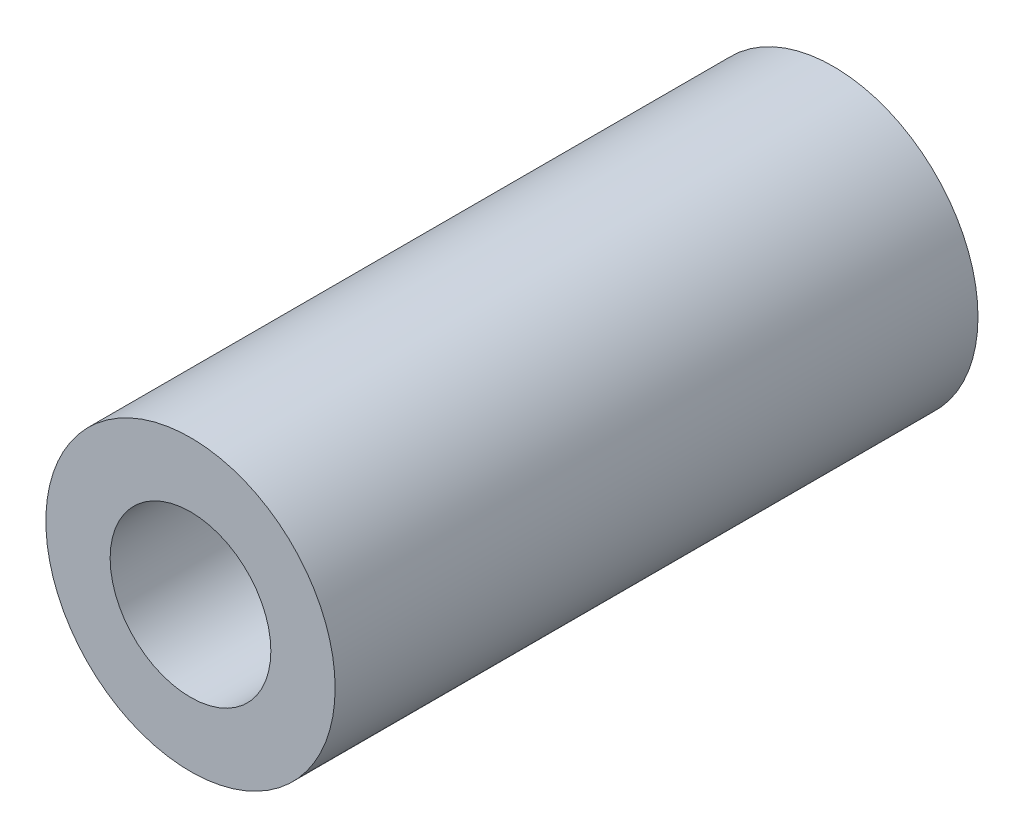
ISO-10303-21;
HEADER;
FILE_DESCRIPTION(('STEP AP214'),'2;1');
FILE_NAME('part.step','',(''),(''),'','','');
FILE_SCHEMA(('AUTOMOTIVE_DESIGN { 1 0 10303 214 1 1 1 1 }'));
ENDSEC;
DATA;
#1=APPLICATION_CONTEXT('core data for automotive mechanical design processes');
#2=APPLICATION_PROTOCOL_DEFINITION('international standard','automotive_design',2000,#1);
#3=PRODUCT_CONTEXT('',#1,'mechanical');
#4=PRODUCT('Part','Part','',(#3));
#5=PRODUCT_RELATED_PRODUCT_CATEGORY('part','',(#4));
#6=PRODUCT_DEFINITION_FORMATION('','',#4);
#7=PRODUCT_DEFINITION_CONTEXT('part definition',#1,'design');
#8=PRODUCT_DEFINITION('design','',#6,#7);
#9=PRODUCT_DEFINITION_SHAPE('','',#8);
#10=(LENGTH_UNIT() NAMED_UNIT(*) SI_UNIT(.MILLI.,.METRE.));
#11=(NAMED_UNIT(*) PLANE_ANGLE_UNIT() SI_UNIT($,.RADIAN.));
#12=(NAMED_UNIT(*) SI_UNIT($,.STERADIAN.) SOLID_ANGLE_UNIT());
#13=UNCERTAINTY_MEASURE_WITH_UNIT(LENGTH_MEASURE(1.E-05),#10,'distance_accuracy_value','');
#14=(GEOMETRIC_REPRESENTATION_CONTEXT(3) GLOBAL_UNCERTAINTY_ASSIGNED_CONTEXT((#13)) GLOBAL_UNIT_ASSIGNED_CONTEXT((#10,
#11,#12)) REPRESENTATION_CONTEXT('',''));
#15=CARTESIAN_POINT('',(0.,0.,0.));
#16=DIRECTION('',(0.,0.,1.));
#17=DIRECTION('',(1.,0.,0.));
#18=AXIS2_PLACEMENT_3D('',#15,#16,#17);
#19=CARTESIAN_POINT('',(0.,0.,14.));
#20=DIRECTION('',(0.,0.,1.));
#21=DIRECTION('',(1.,0.,0.));
#22=AXIS2_PLACEMENT_3D('',#19,#20,#21);
#23=PLANE('',#22);
#24=CARTESIAN_POINT('',(0.,0.,14.));
#25=DIRECTION('',(0.,0.,1.));
#26=DIRECTION('',(1.,0.,0.));
#27=AXIS2_PLACEMENT_3D('',#24,#25,#26);
#28=CIRCLE('',#27,3.15);
#29=CARTESIAN_POINT('',(3.15,0.,14.));
#30=VERTEX_POINT('',#29);
#31=EDGE_CURVE('E10',#30,#30,#28,.T.);
#32=ORIENTED_EDGE('',*,*,#31,.T.);
#33=EDGE_LOOP('',(#32));
#34=FACE_BOUND('',#33,.T.);
#35=CARTESIAN_POINT('',(0.,0.,14.));
#36=DIRECTION('',(0.,0.,1.));
#37=DIRECTION('',(1.,0.,0.));
#38=AXIS2_PLACEMENT_3D('',#35,#36,#37);
#39=CIRCLE('',#38,1.75);
#40=CARTESIAN_POINT('',(1.75,0.,14.));
#41=VERTEX_POINT('',#40);
#42=EDGE_CURVE('E41',#41,#41,#39,.T.);
#43=ORIENTED_EDGE('',*,*,#42,.F.);
#44=EDGE_LOOP('',(#43));
#45=FACE_BOUND('',#44,.T.);
#46=ADVANCED_FACE('F30',(#34,#45),#23,.T.);
#47=CARTESIAN_POINT('',(0.,0.,0.));
#48=DIRECTION('',(0.,0.,1.));
#49=DIRECTION('',(1.,0.,0.));
#50=AXIS2_PLACEMENT_3D('',#47,#48,#49);
#51=PLANE('',#50);
#52=CARTESIAN_POINT('',(0.,0.,0.));
#53=DIRECTION('',(0.,0.,1.));
#54=DIRECTION('',(1.,0.,0.));
#55=AXIS2_PLACEMENT_3D('',#52,#53,#54);
#56=CIRCLE('',#55,3.15);
#57=CARTESIAN_POINT('',(3.15,0.,0.));
#58=VERTEX_POINT('',#57);
#59=EDGE_CURVE('E34',#58,#58,#56,.T.);
#60=ORIENTED_EDGE('',*,*,#59,.F.);
#61=EDGE_LOOP('',(#60));
#62=FACE_BOUND('',#61,.T.);
#63=CARTESIAN_POINT('',(0.,0.,0.));
#64=DIRECTION('',(0.,0.,1.));
#65=DIRECTION('',(1.,0.,0.));
#66=AXIS2_PLACEMENT_3D('',#63,#64,#65);
#67=CIRCLE('',#66,1.75);
#68=CARTESIAN_POINT('',(1.75,0.,0.));
#69=VERTEX_POINT('',#68);
#70=EDGE_CURVE('E43',#69,#69,#67,.T.);
#71=ORIENTED_EDGE('',*,*,#70,.T.);
#72=EDGE_LOOP('',(#71));
#73=FACE_BOUND('',#72,.T.);
#74=ADVANCED_FACE('F53',(#62,#73),#51,.F.);
#75=CARTESIAN_POINT('',(0.,0.,14.));
#76=DIRECTION('',(0.,0.,-1.));
#77=DIRECTION('',(-1.,0.,0.));
#78=AXIS2_PLACEMENT_3D('',#75,#76,#77);
#79=CYLINDRICAL_SURFACE('',#78,3.15);
#80=ORIENTED_EDGE('',*,*,#31,.F.);
#81=EDGE_LOOP('',(#80));
#82=FACE_BOUND('',#81,.T.);
#83=ORIENTED_EDGE('',*,*,#59,.T.);
#84=EDGE_LOOP('',(#83));
#85=FACE_BOUND('',#84,.T.);
#86=ADVANCED_FACE('F32',(#82,#85),#79,.T.);
#87=CARTESIAN_POINT('',(0.,0.,14.));
#88=DIRECTION('',(0.,0.,-1.));
#89=DIRECTION('',(-1.,0.,0.));
#90=AXIS2_PLACEMENT_3D('',#87,#88,#89);
#91=CYLINDRICAL_SURFACE('',#90,1.75);
#92=ORIENTED_EDGE('',*,*,#42,.T.);
#93=EDGE_LOOP('',(#92));
#94=FACE_BOUND('',#93,.T.);
#95=ORIENTED_EDGE('',*,*,#70,.F.);
#96=EDGE_LOOP('',(#95));
#97=FACE_BOUND('',#96,.T.);
#98=ADVANCED_FACE('F49',(#94,#97),#91,.F.);
#99=CLOSED_SHELL('',(#46,#74,#86,#98));
#100=MANIFOLD_SOLID_BREP('B2',#99);
#101=ADVANCED_BREP_SHAPE_REPRESENTATION('',(#18,#100),#14);
#102=SHAPE_DEFINITION_REPRESENTATION(#9,#101);
ENDSEC;
END-ISO-10303-21;
